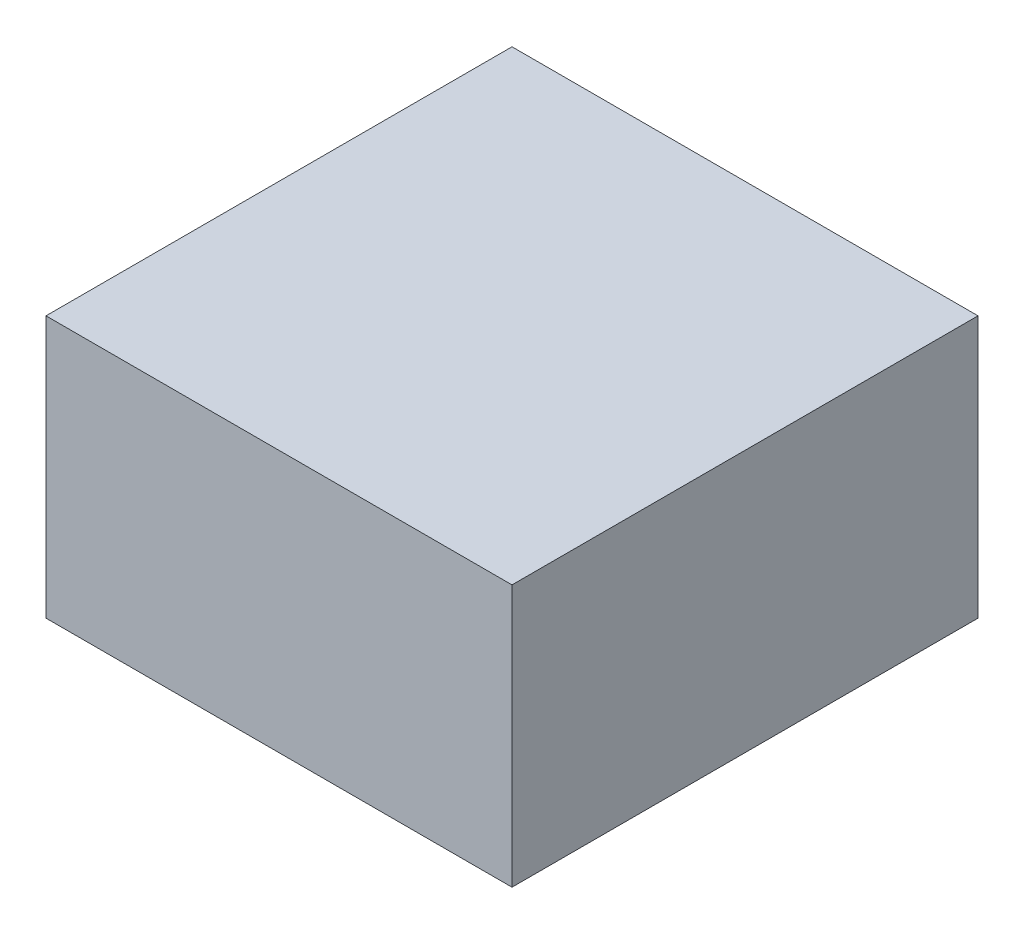
ISO-10303-21;
HEADER;
FILE_DESCRIPTION(('STEP AP214'),'2;1');
FILE_NAME('part.step','',(''),(''),'','','');
FILE_SCHEMA(('AUTOMOTIVE_DESIGN { 1 0 10303 214 1 1 1 1 }'));
ENDSEC;
DATA;
#1=APPLICATION_CONTEXT('core data for automotive mechanical design processes');
#2=APPLICATION_PROTOCOL_DEFINITION('international standard','automotive_design',2000,#1);
#3=PRODUCT_CONTEXT('',#1,'mechanical');
#4=PRODUCT('Part','Part','',(#3));
#5=PRODUCT_RELATED_PRODUCT_CATEGORY('part','',(#4));
#6=PRODUCT_DEFINITION_FORMATION('','',#4);
#7=PRODUCT_DEFINITION_CONTEXT('part definition',#1,'design');
#8=PRODUCT_DEFINITION('design','',#6,#7);
#9=PRODUCT_DEFINITION_SHAPE('','',#8);
#10=(LENGTH_UNIT() NAMED_UNIT(*) SI_UNIT(.MILLI.,.METRE.));
#11=(NAMED_UNIT(*) PLANE_ANGLE_UNIT() SI_UNIT($,.RADIAN.));
#12=(NAMED_UNIT(*) SI_UNIT($,.STERADIAN.) SOLID_ANGLE_UNIT());
#13=UNCERTAINTY_MEASURE_WITH_UNIT(LENGTH_MEASURE(1.E-05),#10,'distance_accuracy_value','');
#14=(GEOMETRIC_REPRESENTATION_CONTEXT(3) GLOBAL_UNCERTAINTY_ASSIGNED_CONTEXT((#13)) GLOBAL_UNIT_ASSIGNED_CONTEXT((#10,
#11,#12)) REPRESENTATION_CONTEXT('',''));
#15=CARTESIAN_POINT('',(0.,0.,0.));
#16=DIRECTION('',(0.,0.,1.));
#17=DIRECTION('',(1.,0.,0.));
#18=AXIS2_PLACEMENT_3D('',#15,#16,#17);
#19=CARTESIAN_POINT('',(-16.27728245926,3.947980609798,5.315515978186));
#20=DIRECTION('',(0.,1.,0.));
#21=DIRECTION('',(0.,0.,1.));
#22=AXIS2_PLACEMENT_3D('',#19,#20,#21);
#23=PLANE('',#22);
#24=DIRECTION('',(1.,0.,0.));
#25=VECTOR('',#24,1.);
#26=CARTESIAN_POINT('',(-16.27728245926,3.947980609798,-15.68448402181));
#27=LINE('',#26,#25);
#28=CARTESIAN_POINT('',(-16.27728245926,3.947980609798,-15.68448402181));
#29=VERTEX_POINT('',#28);
#30=CARTESIAN_POINT('',(4.722717540733,3.947980609798,-15.68448402181));
#31=VERTEX_POINT('',#30);
#32=EDGE_CURVE('E81',#29,#31,#27,.T.);
#33=ORIENTED_EDGE('',*,*,#32,.T.);
#34=DIRECTION('',(0.,0.,1.));
#35=VECTOR('',#34,1.);
#36=CARTESIAN_POINT('',(4.722717540733,3.947980609798,-15.68448402181));
#37=LINE('',#36,#35);
#38=CARTESIAN_POINT('',(4.722717540733,3.947980609798,5.315515978186));
#39=VERTEX_POINT('',#38);
#40=EDGE_CURVE('E68',#31,#39,#37,.T.);
#41=ORIENTED_EDGE('',*,*,#40,.T.);
#42=DIRECTION('',(-1.,0.,0.));
#43=VECTOR('',#42,1.);
#44=CARTESIAN_POINT('',(-16.27728245926,3.947980609798,5.315515978186));
#45=LINE('',#44,#43);
#46=CARTESIAN_POINT('',(-16.27728245926,3.947980609798,5.315515978186));
#47=VERTEX_POINT('',#46);
#48=EDGE_CURVE('E55',#39,#47,#45,.T.);
#49=ORIENTED_EDGE('',*,*,#48,.T.);
#50=DIRECTION('',(0.,0.,-1.));
#51=VECTOR('',#50,1.);
#52=CARTESIAN_POINT('',(-16.27728245926,3.947980609798,-15.68448402181));
#53=LINE('',#52,#51);
#54=EDGE_CURVE('E20',#47,#29,#53,.T.);
#55=ORIENTED_EDGE('',*,*,#54,.T.);
#56=EDGE_LOOP('',(#33,#41,#49,#55));
#57=FACE_BOUND('',#56,.T.);
#58=ADVANCED_FACE('F17',(#57),#23,.F.);
#59=CARTESIAN_POINT('',(-16.27728245926,15.747980609798,-15.68448402181));
#60=DIRECTION('',(1.,0.,0.));
#61=DIRECTION('',(0.,0.,-1.));
#62=AXIS2_PLACEMENT_3D('',#59,#60,#61);
#63=PLANE('',#62);
#64=DIRECTION('',(0.,1.,0.));
#65=VECTOR('',#64,1.);
#66=CARTESIAN_POINT('',(-16.27728245926,15.747980609798,5.315515978186));
#67=LINE('',#66,#65);
#68=CARTESIAN_POINT('',(-16.27728245926,15.747980609798,5.315515978186));
#69=VERTEX_POINT('',#68);
#70=EDGE_CURVE('E61',#47,#69,#67,.T.);
#71=ORIENTED_EDGE('',*,*,#70,.T.);
#72=DIRECTION('',(0.,0.,1.));
#73=VECTOR('',#72,1.);
#74=CARTESIAN_POINT('',(-16.27728245926,15.747980609798,5.315515978186));
#75=LINE('',#74,#73);
#76=CARTESIAN_POINT('',(-16.27728245926,15.747980609798,-15.68448402181));
#77=VERTEX_POINT('',#76);
#78=EDGE_CURVE('E83',#77,#69,#75,.T.);
#79=ORIENTED_EDGE('',*,*,#78,.F.);
#80=DIRECTION('',(0.,1.,0.));
#81=VECTOR('',#80,1.);
#82=CARTESIAN_POINT('',(-16.27728245926,15.747980609798,-15.68448402181));
#83=LINE('',#82,#81);
#84=EDGE_CURVE('E64',#77,#29,#83,.F.);
#85=ORIENTED_EDGE('',*,*,#84,.T.);
#86=ORIENTED_EDGE('',*,*,#54,.F.);
#87=EDGE_LOOP('',(#71,#79,#85,#86));
#88=FACE_BOUND('',#87,.T.);
#89=ADVANCED_FACE('F60',(#88),#63,.F.);
#90=CARTESIAN_POINT('',(-16.27728245926,15.747980609798,5.315515978186));
#91=DIRECTION('',(0.,0.,-1.));
#92=DIRECTION('',(-1.,0.,0.));
#93=AXIS2_PLACEMENT_3D('',#90,#91,#92);
#94=PLANE('',#93);
#95=DIRECTION('',(0.,1.,0.));
#96=VECTOR('',#95,1.);
#97=CARTESIAN_POINT('',(4.722717540733,15.747980609798,5.315515978186));
#98=LINE('',#97,#96);
#99=CARTESIAN_POINT('',(4.722717540733,15.747980609798,5.315515978186));
#100=VERTEX_POINT('',#99);
#101=EDGE_CURVE('E70',#39,#100,#98,.T.);
#102=ORIENTED_EDGE('',*,*,#101,.T.);
#103=DIRECTION('',(1.,0.,0.));
#104=VECTOR('',#103,1.);
#105=CARTESIAN_POINT('',(-16.27728245926,15.747980609798,5.315515978186));
#106=LINE('',#105,#104);
#107=EDGE_CURVE('E74',#69,#100,#106,.T.);
#108=ORIENTED_EDGE('',*,*,#107,.F.);
#109=ORIENTED_EDGE('',*,*,#70,.F.);
#110=ORIENTED_EDGE('',*,*,#48,.F.);
#111=EDGE_LOOP('',(#102,#108,#109,#110));
#112=FACE_BOUND('',#111,.T.);
#113=ADVANCED_FACE('F72',(#112),#94,.F.);
#114=CARTESIAN_POINT('',(4.722717540733,15.747980609798,-15.68448402181));
#115=DIRECTION('',(-1.,0.,0.));
#116=DIRECTION('',(0.,0.,1.));
#117=AXIS2_PLACEMENT_3D('',#114,#115,#116);
#118=PLANE('',#117);
#119=DIRECTION('',(0.,1.,0.));
#120=VECTOR('',#119,1.);
#121=CARTESIAN_POINT('',(4.722717540733,15.747980609798,-15.68448402181));
#122=LINE('',#121,#120);
#123=CARTESIAN_POINT('',(4.722717540733,15.747980609798,-15.68448402181));
#124=VERTEX_POINT('',#123);
#125=EDGE_CURVE('E35',#31,#124,#122,.T.);
#126=ORIENTED_EDGE('',*,*,#125,.T.);
#127=DIRECTION('',(0.,0.,1.));
#128=VECTOR('',#127,1.);
#129=CARTESIAN_POINT('',(4.722717540733,15.747980609798,5.315515978186));
#130=LINE('',#129,#128);
#131=EDGE_CURVE('E26',#100,#124,#130,.F.);
#132=ORIENTED_EDGE('',*,*,#131,.F.);
#133=ORIENTED_EDGE('',*,*,#101,.F.);
#134=ORIENTED_EDGE('',*,*,#40,.F.);
#135=EDGE_LOOP('',(#126,#132,#133,#134));
#136=FACE_BOUND('',#135,.T.);
#137=ADVANCED_FACE('F89',(#136),#118,.F.);
#138=CARTESIAN_POINT('',(-16.27728245926,15.747980609798,-15.68448402181));
#139=DIRECTION('',(0.,0.,1.));
#140=DIRECTION('',(1.,0.,0.));
#141=AXIS2_PLACEMENT_3D('',#138,#139,#140);
#142=PLANE('',#141);
#143=ORIENTED_EDGE('',*,*,#84,.F.);
#144=DIRECTION('',(1.,0.,0.));
#145=VECTOR('',#144,1.);
#146=CARTESIAN_POINT('',(-16.27728245926,15.747980609798,-15.68448402181));
#147=LINE('',#146,#145);
#148=EDGE_CURVE('E11',#124,#77,#147,.F.);
#149=ORIENTED_EDGE('',*,*,#148,.F.);
#150=ORIENTED_EDGE('',*,*,#125,.F.);
#151=ORIENTED_EDGE('',*,*,#32,.F.);
#152=EDGE_LOOP('',(#143,#149,#150,#151));
#153=FACE_BOUND('',#152,.T.);
#154=ADVANCED_FACE('F91',(#153),#142,.F.);
#155=CARTESIAN_POINT('',(-16.27728245926,15.747980609798,5.315515978186));
#156=DIRECTION('',(0.,1.,0.));
#157=DIRECTION('',(0.,0.,1.));
#158=AXIS2_PLACEMENT_3D('',#155,#156,#157);
#159=PLANE('',#158);
#160=ORIENTED_EDGE('',*,*,#131,.T.);
#161=ORIENTED_EDGE('',*,*,#148,.T.);
#162=ORIENTED_EDGE('',*,*,#78,.T.);
#163=ORIENTED_EDGE('',*,*,#107,.T.);
#164=EDGE_LOOP('',(#160,#161,#162,#163));
#165=FACE_BOUND('',#164,.T.);
#166=ADVANCED_FACE('F88',(#165),#159,.T.);
#167=CLOSED_SHELL('',(#58,#89,#113,#137,#154,#166));
#168=MANIFOLD_SOLID_BREP('B1',#167);
#169=ADVANCED_BREP_SHAPE_REPRESENTATION('',(#18,#168),#14);
#170=SHAPE_DEFINITION_REPRESENTATION(#9,#169);
ENDSEC;
END-ISO-10303-21;
